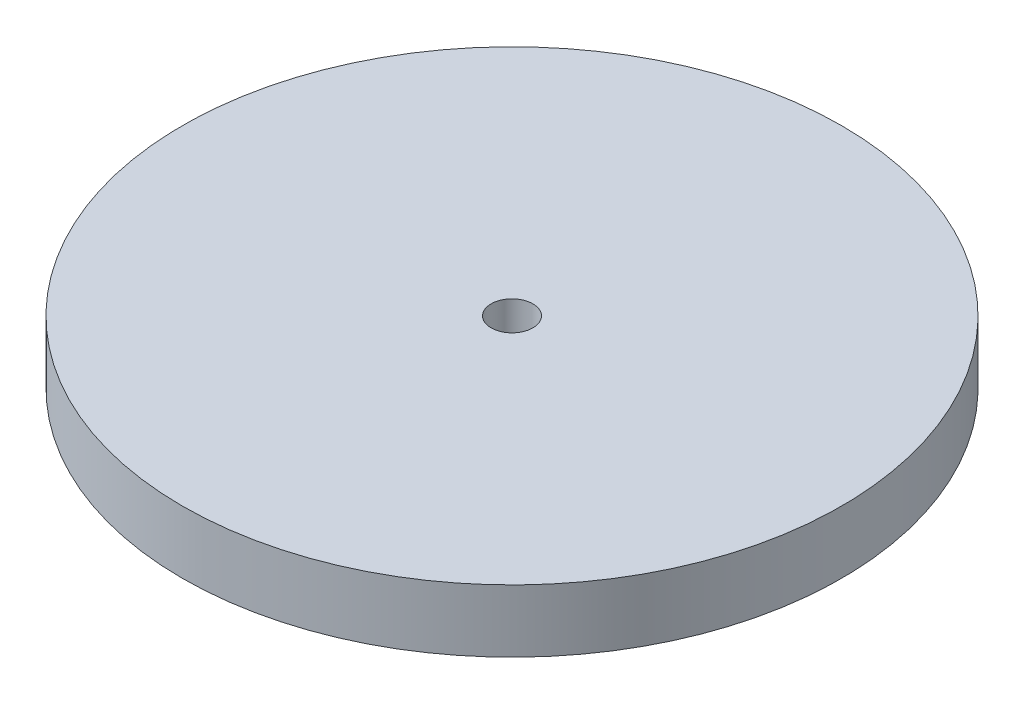
ISO-10303-21;
HEADER;
FILE_DESCRIPTION(('STEP AP214'),'2;1');
FILE_NAME('part.step','',(''),(''),'','','');
FILE_SCHEMA(('AUTOMOTIVE_DESIGN { 1 0 10303 214 1 1 1 1 }'));
ENDSEC;
DATA;
#1=APPLICATION_CONTEXT('core data for automotive mechanical design processes');
#2=APPLICATION_PROTOCOL_DEFINITION('international standard','automotive_design',2000,#1);
#3=PRODUCT_CONTEXT('',#1,'mechanical');
#4=PRODUCT('Part','Part','',(#3));
#5=PRODUCT_RELATED_PRODUCT_CATEGORY('part','',(#4));
#6=PRODUCT_DEFINITION_FORMATION('','',#4);
#7=PRODUCT_DEFINITION_CONTEXT('part definition',#1,'design');
#8=PRODUCT_DEFINITION('design','',#6,#7);
#9=PRODUCT_DEFINITION_SHAPE('','',#8);
#10=(LENGTH_UNIT() NAMED_UNIT(*) SI_UNIT(.MILLI.,.METRE.));
#11=(NAMED_UNIT(*) PLANE_ANGLE_UNIT() SI_UNIT($,.RADIAN.));
#12=(NAMED_UNIT(*) SI_UNIT($,.STERADIAN.) SOLID_ANGLE_UNIT());
#13=UNCERTAINTY_MEASURE_WITH_UNIT(LENGTH_MEASURE(1.E-05),#10,'distance_accuracy_value','');
#14=(GEOMETRIC_REPRESENTATION_CONTEXT(3) GLOBAL_UNCERTAINTY_ASSIGNED_CONTEXT((#13)) GLOBAL_UNIT_ASSIGNED_CONTEXT((#10,
#11,#12)) REPRESENTATION_CONTEXT('',''));
#15=CARTESIAN_POINT('',(0.,0.,0.));
#16=DIRECTION('',(0.,0.,1.));
#17=DIRECTION('',(1.,0.,0.));
#18=AXIS2_PLACEMENT_3D('',#15,#16,#17);
#19=CARTESIAN_POINT('',(0.,30.,0.));
#20=DIRECTION('',(0.,1.,0.));
#21=DIRECTION('',(0.,0.,1.));
#22=AXIS2_PLACEMENT_3D('',#19,#20,#21);
#23=PLANE('',#22);
#24=CARTESIAN_POINT('',(0.,30.,0.));
#25=DIRECTION('',(0.,1.,0.));
#26=DIRECTION('',(0.,0.,1.));
#27=AXIS2_PLACEMENT_3D('',#24,#25,#26);
#28=CIRCLE('',#27,157.89);
#29=CARTESIAN_POINT('',(0.,30.,157.89));
#30=VERTEX_POINT('',#29);
#31=EDGE_CURVE('E10',#30,#30,#28,.T.);
#32=ORIENTED_EDGE('',*,*,#31,.T.);
#33=EDGE_LOOP('',(#32));
#34=FACE_BOUND('',#33,.T.);
#35=CARTESIAN_POINT('',(0.,30.,0.));
#36=DIRECTION('',(0.,1.,0.));
#37=DIRECTION('',(0.,0.,1.));
#38=AXIS2_PLACEMENT_3D('',#35,#36,#37);
#39=CIRCLE('',#38,10.);
#40=CARTESIAN_POINT('',(0.,30.,10.));
#41=VERTEX_POINT('',#40);
#42=EDGE_CURVE('E50',#41,#41,#39,.T.);
#43=ORIENTED_EDGE('',*,*,#42,.F.);
#44=EDGE_LOOP('',(#43));
#45=FACE_BOUND('',#44,.T.);
#46=ADVANCED_FACE('F37',(#34,#45),#23,.T.);
#47=CARTESIAN_POINT('',(0.,0.,0.));
#48=DIRECTION('',(0.,1.,0.));
#49=DIRECTION('',(0.,0.,1.));
#50=AXIS2_PLACEMENT_3D('',#47,#48,#49);
#51=PLANE('',#50);
#52=CARTESIAN_POINT('',(0.,0.,0.));
#53=DIRECTION('',(0.,1.,0.));
#54=DIRECTION('',(0.,0.,1.));
#55=AXIS2_PLACEMENT_3D('',#52,#53,#54);
#56=CIRCLE('',#55,157.89);
#57=CARTESIAN_POINT('',(0.,0.,157.89));
#58=VERTEX_POINT('',#57);
#59=EDGE_CURVE('E41',#58,#58,#56,.T.);
#60=ORIENTED_EDGE('',*,*,#59,.F.);
#61=EDGE_LOOP('',(#60));
#62=FACE_BOUND('',#61,.T.);
#63=CARTESIAN_POINT('',(0.,0.,0.));
#64=DIRECTION('',(0.,1.,0.));
#65=DIRECTION('',(0.,0.,1.));
#66=AXIS2_PLACEMENT_3D('',#63,#64,#65);
#67=CIRCLE('',#66,10.);
#68=CARTESIAN_POINT('',(0.,0.,10.));
#69=VERTEX_POINT('',#68);
#70=EDGE_CURVE('E52',#69,#69,#67,.T.);
#71=ORIENTED_EDGE('',*,*,#70,.T.);
#72=EDGE_LOOP('',(#71));
#73=FACE_BOUND('',#72,.T.);
#74=ADVANCED_FACE('F64',(#62,#73),#51,.F.);
#75=CARTESIAN_POINT('',(0.,30.,0.));
#76=DIRECTION('',(0.,-1.,0.));
#77=DIRECTION('',(0.,0.,-1.));
#78=AXIS2_PLACEMENT_3D('',#75,#76,#77);
#79=CYLINDRICAL_SURFACE('',#78,157.89);
#80=ORIENTED_EDGE('',*,*,#31,.F.);
#81=EDGE_LOOP('',(#80));
#82=FACE_BOUND('',#81,.T.);
#83=ORIENTED_EDGE('',*,*,#59,.T.);
#84=EDGE_LOOP('',(#83));
#85=FACE_BOUND('',#84,.T.);
#86=ADVANCED_FACE('F39',(#82,#85),#79,.T.);
#87=CARTESIAN_POINT('',(0.,30.,0.));
#88=DIRECTION('',(0.,-1.,0.));
#89=DIRECTION('',(0.,0.,-1.));
#90=AXIS2_PLACEMENT_3D('',#87,#88,#89);
#91=CYLINDRICAL_SURFACE('',#90,10.);
#92=ORIENTED_EDGE('',*,*,#42,.T.);
#93=EDGE_LOOP('',(#92));
#94=FACE_BOUND('',#93,.T.);
#95=ORIENTED_EDGE('',*,*,#70,.F.);
#96=EDGE_LOOP('',(#95));
#97=FACE_BOUND('',#96,.T.);
#98=ADVANCED_FACE('F60',(#94,#97),#91,.F.);
#99=CLOSED_SHELL('',(#46,#74,#86,#98));
#100=MANIFOLD_SOLID_BREP('B2',#99);
#101=ADVANCED_BREP_SHAPE_REPRESENTATION('',(#18,#100),#14);
#102=SHAPE_DEFINITION_REPRESENTATION(#9,#101);
ENDSEC;
END-ISO-10303-21;
